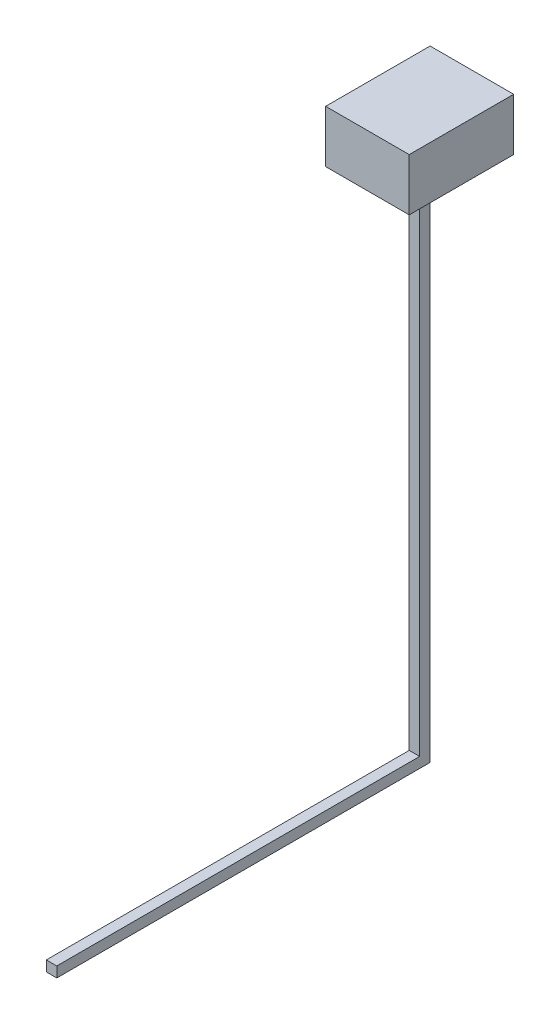
ISO-10303-21;
HEADER;
FILE_DESCRIPTION(('STEP AP214'),'2;1');
FILE_NAME('part.step','',(''),(''),'','','');
FILE_SCHEMA(('AUTOMOTIVE_DESIGN { 1 0 10303 214 1 1 1 1 }'));
ENDSEC;
DATA;
#1=APPLICATION_CONTEXT('core data for automotive mechanical design processes');
#2=APPLICATION_PROTOCOL_DEFINITION('international standard','automotive_design',2000,#1);
#3=PRODUCT_CONTEXT('',#1,'mechanical');
#4=PRODUCT('Part','Part','',(#3));
#5=PRODUCT_RELATED_PRODUCT_CATEGORY('part','',(#4));
#6=PRODUCT_DEFINITION_FORMATION('','',#4);
#7=PRODUCT_DEFINITION_CONTEXT('part definition',#1,'design');
#8=PRODUCT_DEFINITION('design','',#6,#7);
#9=PRODUCT_DEFINITION_SHAPE('','',#8);
#10=(LENGTH_UNIT() NAMED_UNIT(*) SI_UNIT(.MILLI.,.METRE.));
#11=(NAMED_UNIT(*) PLANE_ANGLE_UNIT() SI_UNIT($,.RADIAN.));
#12=(NAMED_UNIT(*) SI_UNIT($,.STERADIAN.) SOLID_ANGLE_UNIT());
#13=UNCERTAINTY_MEASURE_WITH_UNIT(LENGTH_MEASURE(1.E-05),#10,'distance_accuracy_value','');
#14=(GEOMETRIC_REPRESENTATION_CONTEXT(3) GLOBAL_UNCERTAINTY_ASSIGNED_CONTEXT((#13)) GLOBAL_UNIT_ASSIGNED_CONTEXT((#10,
#11,#12)) REPRESENTATION_CONTEXT('',''));
#15=CARTESIAN_POINT('',(0.,0.,0.));
#16=DIRECTION('',(0.,0.,1.));
#17=DIRECTION('',(1.,0.,0.));
#18=AXIS2_PLACEMENT_3D('',#15,#16,#17);
#19=CARTESIAN_POINT('',(10.,0.,-357.360716499269));
#20=DIRECTION('',(0.,0.,1.));
#21=DIRECTION('',(0.,-1.,0.));
#22=AXIS2_PLACEMENT_3D('',#19,#20,#21);
#23=PLANE('',#22);
#24=DIRECTION('',(0.,1.,0.));
#25=VECTOR('',#24,1.);
#26=CARTESIAN_POINT('',(0.,0.,-357.360716499269));
#27=LINE('',#26,#25);
#28=CARTESIAN_POINT('',(0.,0.,-357.360716499269));
#29=VERTEX_POINT('',#28);
#30=CARTESIAN_POINT('',(0.,498.91427325721,-357.360716499269));
#31=VERTEX_POINT('',#30);
#32=EDGE_CURVE('E126',#29,#31,#27,.T.);
#33=ORIENTED_EDGE('',*,*,#32,.T.);
#34=DIRECTION('',(-1.,0.,0.));
#35=VECTOR('',#34,1.);
#36=CARTESIAN_POINT('',(10.,498.91427325721,-357.360716499269));
#37=LINE('',#36,#35);
#38=CARTESIAN_POINT('',(10.,498.91427325721,-357.360716499269));
#39=VERTEX_POINT('',#38);
#40=EDGE_CURVE('E11',#39,#31,#37,.T.);
#41=ORIENTED_EDGE('',*,*,#40,.F.);
#42=DIRECTION('',(0.,1.,0.));
#43=VECTOR('',#42,1.);
#44=CARTESIAN_POINT('',(10.,0.,-357.360716499269));
#45=LINE('',#44,#43);
#46=CARTESIAN_POINT('',(10.,0.,-357.360716499269));
#47=VERTEX_POINT('',#46);
#48=EDGE_CURVE('E164',#47,#39,#45,.T.);
#49=ORIENTED_EDGE('',*,*,#48,.F.);
#50=DIRECTION('',(-1.,0.,0.));
#51=VECTOR('',#50,1.);
#52=CARTESIAN_POINT('',(10.,0.,-357.360716499269));
#53=LINE('',#52,#51);
#54=EDGE_CURVE('E174',#47,#29,#53,.T.);
#55=ORIENTED_EDGE('',*,*,#54,.T.);
#56=EDGE_LOOP('',(#33,#41,#49,#55));
#57=FACE_BOUND('',#56,.T.);
#58=ADVANCED_FACE('F33',(#57),#23,.F.);
#59=CARTESIAN_POINT('',(10.,498.91427325721,-347.360716499269));
#60=DIRECTION('',(0.,0.,-1.));
#61=DIRECTION('',(0.,1.,0.));
#62=AXIS2_PLACEMENT_3D('',#59,#60,#61);
#63=PLANE('',#62);
#64=DIRECTION('',(0.,-1.,0.));
#65=VECTOR('',#64,1.);
#66=CARTESIAN_POINT('',(0.,498.91427325721,-347.360716499269));
#67=LINE('',#66,#65);
#68=CARTESIAN_POINT('',(0.,498.91427325721,-347.360716499269));
#69=VERTEX_POINT('',#68);
#70=CARTESIAN_POINT('',(0.,10.,-347.360716499269));
#71=VERTEX_POINT('',#70);
#72=EDGE_CURVE('E156',#69,#71,#67,.T.);
#73=ORIENTED_EDGE('',*,*,#72,.T.);
#74=DIRECTION('',(-1.,0.,0.));
#75=VECTOR('',#74,1.);
#76=CARTESIAN_POINT('',(10.,10.,-347.360716499269));
#77=LINE('',#76,#75);
#78=CARTESIAN_POINT('',(10.,10.,-347.360716499269));
#79=VERTEX_POINT('',#78);
#80=EDGE_CURVE('E183',#79,#71,#77,.T.);
#81=ORIENTED_EDGE('',*,*,#80,.F.);
#82=DIRECTION('',(0.,-1.,0.));
#83=VECTOR('',#82,1.);
#84=CARTESIAN_POINT('',(10.,498.91427325721,-347.360716499269));
#85=LINE('',#84,#83);
#86=CARTESIAN_POINT('',(10.,498.91427325721,-347.360716499269));
#87=VERTEX_POINT('',#86);
#88=EDGE_CURVE('E168',#87,#79,#85,.T.);
#89=ORIENTED_EDGE('',*,*,#88,.F.);
#90=DIRECTION('',(-1.,0.,0.));
#91=VECTOR('',#90,1.);
#92=CARTESIAN_POINT('',(10.,498.91427325721,-347.360716499269));
#93=LINE('',#92,#91);
#94=EDGE_CURVE('E40',#87,#69,#93,.T.);
#95=ORIENTED_EDGE('',*,*,#94,.T.);
#96=EDGE_LOOP('',(#73,#81,#89,#95));
#97=FACE_BOUND('',#96,.T.);
#98=ADVANCED_FACE('F189',(#97),#63,.F.);
#99=CARTESIAN_POINT('',(10.,10.,-347.360716499269));
#100=DIRECTION('',(0.,-1.,0.));
#101=DIRECTION('',(0.,0.,-1.));
#102=AXIS2_PLACEMENT_3D('',#99,#100,#101);
#103=PLANE('',#102);
#104=DIRECTION('',(0.,0.,1.));
#105=VECTOR('',#104,1.);
#106=CARTESIAN_POINT('',(0.,10.,-347.360716499269));
#107=LINE('',#106,#105);
#108=CARTESIAN_POINT('',(0.,10.,0.));
#109=VERTEX_POINT('',#108);
#110=EDGE_CURVE('E158',#71,#109,#107,.T.);
#111=ORIENTED_EDGE('',*,*,#110,.T.);
#112=DIRECTION('',(-1.,0.,0.));
#113=VECTOR('',#112,1.);
#114=CARTESIAN_POINT('',(10.,10.,0.));
#115=LINE('',#114,#113);
#116=CARTESIAN_POINT('',(10.,10.,0.));
#117=VERTEX_POINT('',#116);
#118=EDGE_CURVE('E180',#117,#109,#115,.T.);
#119=ORIENTED_EDGE('',*,*,#118,.F.);
#120=DIRECTION('',(0.,0.,1.));
#121=VECTOR('',#120,1.);
#122=CARTESIAN_POINT('',(10.,10.,-347.360716499269));
#123=LINE('',#122,#121);
#124=EDGE_CURVE('E170',#79,#117,#123,.T.);
#125=ORIENTED_EDGE('',*,*,#124,.F.);
#126=ORIENTED_EDGE('',*,*,#80,.T.);
#127=EDGE_LOOP('',(#111,#119,#125,#126));
#128=FACE_BOUND('',#127,.T.);
#129=ADVANCED_FACE('F209',(#128),#103,.F.);
#130=CARTESIAN_POINT('',(10.,10.,0.));
#131=DIRECTION('',(0.,0.,-1.));
#132=DIRECTION('',(0.,1.,0.));
#133=AXIS2_PLACEMENT_3D('',#130,#131,#132);
#134=PLANE('',#133);
#135=DIRECTION('',(0.,-1.,0.));
#136=VECTOR('',#135,1.);
#137=CARTESIAN_POINT('',(0.,10.,0.));
#138=LINE('',#137,#136);
#139=CARTESIAN_POINT('',(0.,0.,0.));
#140=VERTEX_POINT('',#139);
#141=EDGE_CURVE('E160',#109,#140,#138,.T.);
#142=ORIENTED_EDGE('',*,*,#141,.T.);
#143=DIRECTION('',(-1.,0.,0.));
#144=VECTOR('',#143,1.);
#145=CARTESIAN_POINT('',(10.,0.,0.));
#146=LINE('',#145,#144);
#147=CARTESIAN_POINT('',(10.,0.,0.));
#148=VERTEX_POINT('',#147);
#149=EDGE_CURVE('E177',#148,#140,#146,.T.);
#150=ORIENTED_EDGE('',*,*,#149,.F.);
#151=DIRECTION('',(0.,-1.,0.));
#152=VECTOR('',#151,1.);
#153=CARTESIAN_POINT('',(10.,10.,0.));
#154=LINE('',#153,#152);
#155=EDGE_CURVE('E52',#117,#148,#154,.T.);
#156=ORIENTED_EDGE('',*,*,#155,.F.);
#157=ORIENTED_EDGE('',*,*,#118,.T.);
#158=EDGE_LOOP('',(#142,#150,#156,#157));
#159=FACE_BOUND('',#158,.T.);
#160=ADVANCED_FACE('F205',(#159),#134,.F.);
#161=CARTESIAN_POINT('',(10.,0.,0.));
#162=DIRECTION('',(0.,1.,0.));
#163=DIRECTION('',(0.,0.,1.));
#164=AXIS2_PLACEMENT_3D('',#161,#162,#163);
#165=PLANE('',#164);
#166=DIRECTION('',(0.,0.,-1.));
#167=VECTOR('',#166,1.);
#168=CARTESIAN_POINT('',(0.,0.,0.));
#169=LINE('',#168,#167);
#170=EDGE_CURVE('E162',#140,#29,#169,.T.);
#171=ORIENTED_EDGE('',*,*,#170,.T.);
#172=ORIENTED_EDGE('',*,*,#54,.F.);
#173=DIRECTION('',(0.,0.,-1.));
#174=VECTOR('',#173,1.);
#175=CARTESIAN_POINT('',(10.,0.,0.));
#176=LINE('',#175,#174);
#177=EDGE_CURVE('E47',#148,#47,#176,.T.);
#178=ORIENTED_EDGE('',*,*,#177,.F.);
#179=ORIENTED_EDGE('',*,*,#149,.T.);
#180=EDGE_LOOP('',(#171,#172,#178,#179));
#181=FACE_BOUND('',#180,.T.);
#182=ADVANCED_FACE('F202',(#181),#165,.F.);
#183=CARTESIAN_POINT('',(10.,498.91427325721,-357.360716499269));
#184=DIRECTION('',(1.,0.,0.));
#185=DIRECTION('',(0.,0.,-1.));
#186=AXIS2_PLACEMENT_3D('',#183,#184,#185);
#187=PLANE('',#186);
#188=ORIENTED_EDGE('',*,*,#48,.T.);
#189=DIRECTION('',(0.,0.,1.));
#190=VECTOR('',#189,1.);
#191=CARTESIAN_POINT('',(10.,498.91427325721,-357.360716499269));
#192=LINE('',#191,#190);
#193=EDGE_CURVE('E166',#39,#87,#192,.T.);
#194=ORIENTED_EDGE('',*,*,#193,.T.);
#195=ORIENTED_EDGE('',*,*,#88,.T.);
#196=ORIENTED_EDGE('',*,*,#124,.T.);
#197=ORIENTED_EDGE('',*,*,#155,.T.);
#198=ORIENTED_EDGE('',*,*,#177,.T.);
#199=EDGE_LOOP('',(#188,#194,#195,#196,#197,#198));
#200=FACE_BOUND('',#199,.T.);
#201=ADVANCED_FACE('F210',(#200),#187,.T.);
#202=CARTESIAN_POINT('',(0.,498.91427325721,-357.360716499269));
#203=DIRECTION('',(1.,0.,0.));
#204=DIRECTION('',(0.,0.,-1.));
#205=AXIS2_PLACEMENT_3D('',#202,#203,#204);
#206=PLANE('',#205);
#207=ORIENTED_EDGE('',*,*,#32,.F.);
#208=ORIENTED_EDGE('',*,*,#170,.F.);
#209=ORIENTED_EDGE('',*,*,#141,.F.);
#210=ORIENTED_EDGE('',*,*,#110,.F.);
#211=ORIENTED_EDGE('',*,*,#72,.F.);
#212=DIRECTION('',(0.,0.,1.));
#213=VECTOR('',#212,1.);
#214=CARTESIAN_POINT('',(0.,498.91427325721,-357.360716499269));
#215=LINE('',#214,#213);
#216=EDGE_CURVE('E153',#31,#69,#215,.T.);
#217=ORIENTED_EDGE('',*,*,#216,.F.);
#218=EDGE_LOOP('',(#207,#208,#209,#210,#211,#217));
#219=FACE_BOUND('',#218,.T.);
#220=ADVANCED_FACE('F196',(#219),#206,.F.);
#221=CARTESIAN_POINT('',(45.,548.91427325721,-302.360716499269));
#222=DIRECTION('',(-1.,0.,0.));
#223=DIRECTION('',(0.,0.,1.));
#224=AXIS2_PLACEMENT_3D('',#221,#222,#223);
#225=PLANE('',#224);
#226=DIRECTION('',(0.,0.,-1.));
#227=VECTOR('',#226,1.);
#228=CARTESIAN_POINT('',(45.,498.91427325721,-302.360716499269));
#229=LINE('',#228,#227);
#230=CARTESIAN_POINT('',(45.,498.91427325721,-302.360716499269));
#231=VERTEX_POINT('',#230);
#232=CARTESIAN_POINT('',(45.,498.91427325721,-402.360716499269));
#233=VERTEX_POINT('',#232);
#234=EDGE_CURVE('E113',#231,#233,#229,.T.);
#235=ORIENTED_EDGE('',*,*,#234,.T.);
#236=DIRECTION('',(0.,-1.,0.));
#237=VECTOR('',#236,1.);
#238=CARTESIAN_POINT('',(45.,548.91427325721,-402.360716499269));
#239=LINE('',#238,#237);
#240=CARTESIAN_POINT('',(45.,548.91427325721,-402.360716499269));
#241=VERTEX_POINT('',#240);
#242=EDGE_CURVE('E120',#241,#233,#239,.T.);
#243=ORIENTED_EDGE('',*,*,#242,.F.);
#244=DIRECTION('',(0.,0.,-1.));
#245=VECTOR('',#244,1.);
#246=CARTESIAN_POINT('',(45.,548.91427325721,-302.360716499269));
#247=LINE('',#246,#245);
#248=CARTESIAN_POINT('',(45.,548.91427325721,-302.360716499269));
#249=VERTEX_POINT('',#248);
#250=EDGE_CURVE('E138',#249,#241,#247,.T.);
#251=ORIENTED_EDGE('',*,*,#250,.F.);
#252=DIRECTION('',(0.,-1.,0.));
#253=VECTOR('',#252,1.);
#254=CARTESIAN_POINT('',(45.,548.91427325721,-302.360716499269));
#255=LINE('',#254,#253);
#256=EDGE_CURVE('E132',#249,#231,#255,.T.);
#257=ORIENTED_EDGE('',*,*,#256,.T.);
#258=EDGE_LOOP('',(#235,#243,#251,#257));
#259=FACE_BOUND('',#258,.T.);
#260=ADVANCED_FACE('F130',(#259),#225,.F.);
#261=CARTESIAN_POINT('',(45.,548.91427325721,-402.360716499269));
#262=DIRECTION('',(0.,0.,1.));
#263=DIRECTION('',(1.,0.,0.));
#264=AXIS2_PLACEMENT_3D('',#261,#262,#263);
#265=PLANE('',#264);
#266=DIRECTION('',(-1.,0.,0.));
#267=VECTOR('',#266,1.);
#268=CARTESIAN_POINT('',(45.,498.91427325721,-402.360716499269));
#269=LINE('',#268,#267);
#270=CARTESIAN_POINT('',(-35.,498.91427325721,-402.360716499269));
#271=VERTEX_POINT('',#270);
#272=EDGE_CURVE('E108',#233,#271,#269,.T.);
#273=ORIENTED_EDGE('',*,*,#272,.T.);
#274=DIRECTION('',(0.,-1.,0.));
#275=VECTOR('',#274,1.);
#276=CARTESIAN_POINT('',(-35.,548.91427325721,-402.360716499269));
#277=LINE('',#276,#275);
#278=CARTESIAN_POINT('',(-35.,548.91427325721,-402.360716499269));
#279=VERTEX_POINT('',#278);
#280=EDGE_CURVE('E127',#279,#271,#277,.T.);
#281=ORIENTED_EDGE('',*,*,#280,.F.);
#282=DIRECTION('',(-1.,0.,0.));
#283=VECTOR('',#282,1.);
#284=CARTESIAN_POINT('',(45.,548.91427325721,-402.360716499269));
#285=LINE('',#284,#283);
#286=EDGE_CURVE('E122',#241,#279,#285,.T.);
#287=ORIENTED_EDGE('',*,*,#286,.F.);
#288=ORIENTED_EDGE('',*,*,#242,.T.);
#289=EDGE_LOOP('',(#273,#281,#287,#288));
#290=FACE_BOUND('',#289,.T.);
#291=ADVANCED_FACE('F121',(#290),#265,.F.);
#292=CARTESIAN_POINT('',(-35.,548.91427325721,-302.360716499269));
#293=DIRECTION('',(1.,0.,0.));
#294=DIRECTION('',(0.,0.,-1.));
#295=AXIS2_PLACEMENT_3D('',#292,#293,#294);
#296=PLANE('',#295);
#297=DIRECTION('',(0.,0.,1.));
#298=VECTOR('',#297,1.);
#299=CARTESIAN_POINT('',(-35.,498.91427325721,-302.360716499269));
#300=LINE('',#299,#298);
#301=CARTESIAN_POINT('',(-35.,498.91427325721,-302.360716499269));
#302=VERTEX_POINT('',#301);
#303=EDGE_CURVE('E114',#271,#302,#300,.T.);
#304=ORIENTED_EDGE('',*,*,#303,.T.);
#305=DIRECTION('',(0.,-1.,0.));
#306=VECTOR('',#305,1.);
#307=CARTESIAN_POINT('',(-35.,548.91427325721,-302.360716499269));
#308=LINE('',#307,#306);
#309=CARTESIAN_POINT('',(-35.,548.91427325721,-302.360716499269));
#310=VERTEX_POINT('',#309);
#311=EDGE_CURVE('E147',#310,#302,#308,.T.);
#312=ORIENTED_EDGE('',*,*,#311,.F.);
#313=DIRECTION('',(0.,0.,1.));
#314=VECTOR('',#313,1.);
#315=CARTESIAN_POINT('',(-35.,548.91427325721,-302.360716499269));
#316=LINE('',#315,#314);
#317=EDGE_CURVE('E141',#279,#310,#316,.T.);
#318=ORIENTED_EDGE('',*,*,#317,.F.);
#319=ORIENTED_EDGE('',*,*,#280,.T.);
#320=EDGE_LOOP('',(#304,#312,#318,#319));
#321=FACE_BOUND('',#320,.T.);
#322=ADVANCED_FACE('F273',(#321),#296,.F.);
#323=CARTESIAN_POINT('',(45.,548.91427325721,-302.360716499269));
#324=DIRECTION('',(0.,0.,-1.));
#325=DIRECTION('',(-1.,0.,0.));
#326=AXIS2_PLACEMENT_3D('',#323,#324,#325);
#327=PLANE('',#326);
#328=DIRECTION('',(1.,0.,0.));
#329=VECTOR('',#328,1.);
#330=CARTESIAN_POINT('',(45.,498.91427325721,-302.360716499269));
#331=LINE('',#330,#329);
#332=EDGE_CURVE('E136',#302,#231,#331,.T.);
#333=ORIENTED_EDGE('',*,*,#332,.T.);
#334=ORIENTED_EDGE('',*,*,#256,.F.);
#335=DIRECTION('',(1.,0.,0.));
#336=VECTOR('',#335,1.);
#337=CARTESIAN_POINT('',(45.,548.91427325721,-302.360716499269));
#338=LINE('',#337,#336);
#339=EDGE_CURVE('E144',#310,#249,#338,.T.);
#340=ORIENTED_EDGE('',*,*,#339,.F.);
#341=ORIENTED_EDGE('',*,*,#311,.T.);
#342=EDGE_LOOP('',(#333,#334,#340,#341));
#343=FACE_BOUND('',#342,.T.);
#344=ADVANCED_FACE('F282',(#343),#327,.F.);
#345=CARTESIAN_POINT('',(45.,548.91427325721,-402.360716499269));
#346=DIRECTION('',(0.,1.,0.));
#347=DIRECTION('',(0.,0.,1.));
#348=AXIS2_PLACEMENT_3D('',#345,#346,#347);
#349=PLANE('',#348);
#350=ORIENTED_EDGE('',*,*,#250,.T.);
#351=ORIENTED_EDGE('',*,*,#286,.T.);
#352=ORIENTED_EDGE('',*,*,#317,.T.);
#353=ORIENTED_EDGE('',*,*,#339,.T.);
#354=EDGE_LOOP('',(#350,#351,#352,#353));
#355=FACE_BOUND('',#354,.T.);
#356=ADVANCED_FACE('F292',(#355),#349,.T.);
#357=CARTESIAN_POINT('',(45.,498.91427325721,-402.360716499269));
#358=DIRECTION('',(0.,1.,0.));
#359=DIRECTION('',(0.,0.,1.));
#360=AXIS2_PLACEMENT_3D('',#357,#358,#359);
#361=PLANE('',#360);
#362=ORIENTED_EDGE('',*,*,#193,.F.);
#363=ORIENTED_EDGE('',*,*,#40,.T.);
#364=ORIENTED_EDGE('',*,*,#216,.T.);
#365=ORIENTED_EDGE('',*,*,#94,.F.);
#366=EDGE_LOOP('',(#362,#363,#364,#365));
#367=FACE_BOUND('',#366,.T.);
#368=ORIENTED_EDGE('',*,*,#234,.F.);
#369=ORIENTED_EDGE('',*,*,#332,.F.);
#370=ORIENTED_EDGE('',*,*,#303,.F.);
#371=ORIENTED_EDGE('',*,*,#272,.F.);
#372=EDGE_LOOP('',(#368,#369,#370,#371));
#373=FACE_BOUND('',#372,.T.);
#374=ADVANCED_FACE('F110',(#367,#373),#361,.F.);
#375=CLOSED_SHELL('',(#58,#98,#129,#160,#182,#201,#220,#260,#291,#322,#344,#356,#374));
#376=MANIFOLD_SOLID_BREP('B2',#375);
#377=ADVANCED_BREP_SHAPE_REPRESENTATION('',(#18,#376),#14);
#378=SHAPE_DEFINITION_REPRESENTATION(#9,#377);
ENDSEC;
END-ISO-10303-21;
